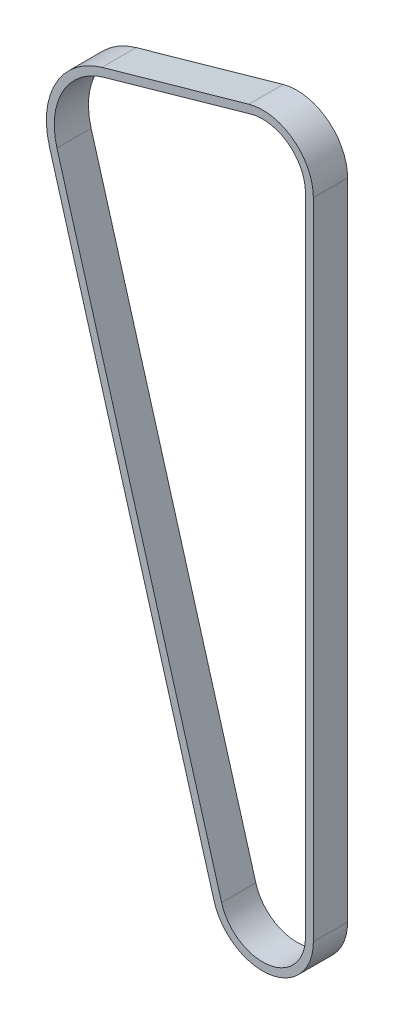
ISO-10303-21;
HEADER;
FILE_DESCRIPTION(('STEP AP214'),'2;1');
FILE_NAME('part.step','',(''),(''),'','','');
FILE_SCHEMA(('AUTOMOTIVE_DESIGN { 1 0 10303 214 1 1 1 1 }'));
ENDSEC;
DATA;
#1=APPLICATION_CONTEXT('core data for automotive mechanical design processes');
#2=APPLICATION_PROTOCOL_DEFINITION('international standard','automotive_design',2000,#1);
#3=PRODUCT_CONTEXT('',#1,'mechanical');
#4=PRODUCT('Part','Part','',(#3));
#5=PRODUCT_RELATED_PRODUCT_CATEGORY('part','',(#4));
#6=PRODUCT_DEFINITION_FORMATION('','',#4);
#7=PRODUCT_DEFINITION_CONTEXT('part definition',#1,'design');
#8=PRODUCT_DEFINITION('design','',#6,#7);
#9=PRODUCT_DEFINITION_SHAPE('','',#8);
#10=(LENGTH_UNIT() NAMED_UNIT(*) SI_UNIT(.MILLI.,.METRE.));
#11=(NAMED_UNIT(*) PLANE_ANGLE_UNIT() SI_UNIT($,.RADIAN.));
#12=(NAMED_UNIT(*) SI_UNIT($,.STERADIAN.) SOLID_ANGLE_UNIT());
#13=UNCERTAINTY_MEASURE_WITH_UNIT(LENGTH_MEASURE(1.E-05),#10,'distance_accuracy_value','');
#14=(GEOMETRIC_REPRESENTATION_CONTEXT(3) GLOBAL_UNCERTAINTY_ASSIGNED_CONTEXT((#13)) GLOBAL_UNIT_ASSIGNED_CONTEXT((#10,
#11,#12)) REPRESENTATION_CONTEXT('',''));
#15=CARTESIAN_POINT('',(0.,0.,0.));
#16=DIRECTION('',(0.,0.,1.));
#17=DIRECTION('',(1.,0.,0.));
#18=AXIS2_PLACEMENT_3D('',#15,#16,#17);
#19=CARTESIAN_POINT('',(-10.0179356323883,44.8653931890896,6.));
#20=DIRECTION('',(0.,0.,1.));
#21=DIRECTION('',(1.,0.,0.));
#22=AXIS2_PLACEMENT_3D('',#19,#20,#21);
#23=PLANE('',#22);
#24=CARTESIAN_POINT('',(-10.0179356323883,44.8653931890896,6.));
#25=DIRECTION('',(0.,0.,1.));
#26=DIRECTION('',(1.,0.,0.));
#27=AXIS2_PLACEMENT_3D('',#24,#25,#26);
#28=CIRCLE('',#27,13.38);
#29=CARTESIAN_POINT('',(-13.6594568226901,57.7403193411334,6.));
#30=VERTEX_POINT('',#29);
#31=CARTESIAN_POINT('',(-22.8742804471024,41.1588047299843,6.));
#32=VERTEX_POINT('',#31);
#33=EDGE_CURVE('E208',#30,#32,#28,.T.);
#34=ORIENTED_EDGE('',*,*,#33,.T.);
#35=DIRECTION('',(0.277024548513102,-0.960862841159503,0.));
#36=VECTOR('',#35,1.);
#37=CARTESIAN_POINT('',(-22.8742804471024,41.1588047299843,6.));
#38=LINE('',#37,#36);
#39=CARTESIAN_POINT('',(5.98547360289192,-58.941585002554,6.));
#40=VERTEX_POINT('',#39);
#41=EDGE_CURVE('E211',#32,#40,#38,.T.);
#42=ORIENTED_EDGE('',*,*,#41,.T.);
#43=CARTESIAN_POINT('',(14.5179356323883,-56.4816070117576,6.));
#44=DIRECTION('',(0.,0.,1.));
#45=DIRECTION('',(1.,0.,0.));
#46=AXIS2_PLACEMENT_3D('',#43,#44,#45);
#47=CIRCLE('',#46,8.87999999999999);
#48=CARTESIAN_POINT('',(23.3979356323883,-56.4816070117576,6.));
#49=VERTEX_POINT('',#48);
#50=EDGE_CURVE('E214',#40,#49,#47,.T.);
#51=ORIENTED_EDGE('',*,*,#50,.T.);
#52=DIRECTION('',(0.,-1.,0.));
#53=VECTOR('',#52,1.);
#54=CARTESIAN_POINT('',(23.3979356323883,56.4816070117576,6.));
#55=LINE('',#54,#53);
#56=CARTESIAN_POINT('',(23.3979356323883,56.4816070117576,6.));
#57=VERTEX_POINT('',#56);
#58=EDGE_CURVE('E216',#57,#49,#55,.T.);
#59=ORIENTED_EDGE('',*,*,#58,.F.);
#60=CARTESIAN_POINT('',(14.5179356323883,56.4816070117576,6.));
#61=DIRECTION('',(0.,0.,1.));
#62=DIRECTION('',(1.,0.,0.));
#63=AXIS2_PLACEMENT_3D('',#60,#61,#62);
#64=CIRCLE('',#63,8.88000000000001);
#65=CARTESIAN_POINT('',(12.1011412998113,65.0264010498854,6.));
#66=VERTEX_POINT('',#65);
#67=EDGE_CURVE('E219',#57,#66,#64,.T.);
#68=ORIENTED_EDGE('',*,*,#67,.T.);
#69=DIRECTION('',(0.962251580870243,0.272161523938852,0.));
#70=VECTOR('',#69,1.);
#71=CARTESIAN_POINT('',(-13.6594568226901,57.7403193411334,6.));
#72=LINE('',#71,#70);
#73=EDGE_CURVE('E221',#30,#66,#72,.T.);
#74=ORIENTED_EDGE('',*,*,#73,.F.);
#75=EDGE_LOOP('',(#34,#42,#51,#59,#68,#74));
#76=FACE_BOUND('',#75,.T.);
#77=DIRECTION('',(0.277024548513102,-0.960862841159503,0.));
#78=VECTOR('',#77,1.);
#79=CARTESIAN_POINT('',(-21.5482897263023,41.5410986069324,6.));
#80=LINE('',#79,#78);
#81=CARTESIAN_POINT('',(-21.5482897263023,41.5410986069324,6.));
#82=VERTEX_POINT('',#81);
#83=CARTESIAN_POINT('',(7.31146432369202,-58.5592911256059,6.));
#84=VERTEX_POINT('',#83);
#85=EDGE_CURVE('E166',#82,#84,#80,.T.);
#86=ORIENTED_EDGE('',*,*,#85,.F.);
#87=CARTESIAN_POINT('',(-10.0179356323883,44.8653931890896,6.));
#88=DIRECTION('',(0.,0.,1.));
#89=DIRECTION('',(1.,0.,0.));
#90=AXIS2_PLACEMENT_3D('',#87,#88,#89);
#91=CIRCLE('',#90,12.);
#92=CARTESIAN_POINT('',(-13.2838739196545,56.4124121595325,6.));
#93=VERTEX_POINT('',#92);
#94=EDGE_CURVE('E158',#93,#82,#91,.T.);
#95=ORIENTED_EDGE('',*,*,#94,.F.);
#96=DIRECTION('',(0.962251580870243,0.272161523938852,0.));
#97=VECTOR('',#96,1.);
#98=CARTESIAN_POINT('',(-13.2838739196545,56.4124121595325,6.));
#99=LINE('',#98,#97);
#100=CARTESIAN_POINT('',(12.4767242028469,63.6984938682845,6.));
#101=VERTEX_POINT('',#100);
#102=EDGE_CURVE('E187',#93,#101,#99,.T.);
#103=ORIENTED_EDGE('',*,*,#102,.T.);
#104=CARTESIAN_POINT('',(14.5179356323883,56.4816070117576,6.));
#105=DIRECTION('',(0.,0.,1.));
#106=DIRECTION('',(1.,0.,0.));
#107=AXIS2_PLACEMENT_3D('',#104,#105,#106);
#108=CIRCLE('',#107,7.50000000000001);
#109=CARTESIAN_POINT('',(22.0179356323883,56.4816070117576,6.));
#110=VERTEX_POINT('',#109);
#111=EDGE_CURVE('E185',#110,#101,#108,.T.);
#112=ORIENTED_EDGE('',*,*,#111,.F.);
#113=DIRECTION('',(0.,-1.,0.));
#114=VECTOR('',#113,1.);
#115=CARTESIAN_POINT('',(22.0179356323883,56.4816070117576,6.));
#116=LINE('',#115,#114);
#117=CARTESIAN_POINT('',(22.0179356323883,-56.4816070117576,6.));
#118=VERTEX_POINT('',#117);
#119=EDGE_CURVE('E181',#110,#118,#116,.T.);
#120=ORIENTED_EDGE('',*,*,#119,.T.);
#121=CARTESIAN_POINT('',(14.5179356323883,-56.4816070117576,6.));
#122=DIRECTION('',(0.,0.,1.));
#123=DIRECTION('',(1.,0.,0.));
#124=AXIS2_PLACEMENT_3D('',#121,#122,#123);
#125=CIRCLE('',#124,7.49999999999999);
#126=EDGE_CURVE('E179',#84,#118,#125,.T.);
#127=ORIENTED_EDGE('',*,*,#126,.F.);
#128=EDGE_LOOP('',(#86,#95,#103,#112,#120,#127));
#129=FACE_BOUND('',#128,.T.);
#130=ADVANCED_FACE('F69',(#76,#129),#23,.T.);
#131=CARTESIAN_POINT('',(-10.0179356323883,44.8653931890896,0.));
#132=DIRECTION('',(0.,0.,1.));
#133=DIRECTION('',(1.,0.,0.));
#134=AXIS2_PLACEMENT_3D('',#131,#132,#133);
#135=PLANE('',#134);
#136=CARTESIAN_POINT('',(-10.0179356323883,44.8653931890896,0.));
#137=DIRECTION('',(0.,0.,1.));
#138=DIRECTION('',(1.,0.,0.));
#139=AXIS2_PLACEMENT_3D('',#136,#137,#138);
#140=CIRCLE('',#139,13.38);
#141=CARTESIAN_POINT('',(-13.6594568226901,57.7403193411334,0.));
#142=VERTEX_POINT('',#141);
#143=CARTESIAN_POINT('',(-22.8742804471024,41.1588047299843,0.));
#144=VERTEX_POINT('',#143);
#145=EDGE_CURVE('E174',#142,#144,#140,.T.);
#146=ORIENTED_EDGE('',*,*,#145,.F.);
#147=DIRECTION('',(0.962251580870243,0.272161523938852,0.));
#148=VECTOR('',#147,1.);
#149=CARTESIAN_POINT('',(-13.6594568226901,57.7403193411334,0.));
#150=LINE('',#149,#148);
#151=CARTESIAN_POINT('',(12.1011412998113,65.0264010498854,0.));
#152=VERTEX_POINT('',#151);
#153=EDGE_CURVE('E212',#142,#152,#150,.T.);
#154=ORIENTED_EDGE('',*,*,#153,.T.);
#155=CARTESIAN_POINT('',(14.5179356323883,56.4816070117576,0.));
#156=DIRECTION('',(0.,0.,1.));
#157=DIRECTION('',(1.,0.,0.));
#158=AXIS2_PLACEMENT_3D('',#155,#156,#157);
#159=CIRCLE('',#158,8.88000000000001);
#160=CARTESIAN_POINT('',(23.3979356323883,56.4816070117576,0.));
#161=VERTEX_POINT('',#160);
#162=EDGE_CURVE('E235',#161,#152,#159,.T.);
#163=ORIENTED_EDGE('',*,*,#162,.F.);
#164=DIRECTION('',(0.,-1.,0.));
#165=VECTOR('',#164,1.);
#166=CARTESIAN_POINT('',(23.3979356323883,56.4816070117576,0.));
#167=LINE('',#166,#165);
#168=CARTESIAN_POINT('',(23.3979356323883,-56.4816070117576,0.));
#169=VERTEX_POINT('',#168);
#170=EDGE_CURVE('E232',#161,#169,#167,.T.);
#171=ORIENTED_EDGE('',*,*,#170,.T.);
#172=CARTESIAN_POINT('',(14.5179356323883,-56.4816070117576,0.));
#173=DIRECTION('',(0.,0.,1.));
#174=DIRECTION('',(1.,0.,0.));
#175=AXIS2_PLACEMENT_3D('',#172,#173,#174);
#176=CIRCLE('',#175,8.87999999999999);
#177=CARTESIAN_POINT('',(5.98547360289192,-58.941585002554,0.));
#178=VERTEX_POINT('',#177);
#179=EDGE_CURVE('E229',#178,#169,#176,.T.);
#180=ORIENTED_EDGE('',*,*,#179,.F.);
#181=DIRECTION('',(0.277024548513102,-0.960862841159503,0.));
#182=VECTOR('',#181,1.);
#183=CARTESIAN_POINT('',(-22.8742804471024,41.1588047299843,0.));
#184=LINE('',#183,#182);
#185=EDGE_CURVE('E227',#144,#178,#184,.T.);
#186=ORIENTED_EDGE('',*,*,#185,.F.);
#187=EDGE_LOOP('',(#146,#154,#163,#171,#180,#186));
#188=FACE_BOUND('',#187,.T.);
#189=CARTESIAN_POINT('',(-10.0179356323883,44.8653931890896,0.));
#190=DIRECTION('',(0.,0.,1.));
#191=DIRECTION('',(1.,0.,0.));
#192=AXIS2_PLACEMENT_3D('',#189,#190,#191);
#193=CIRCLE('',#192,12.);
#194=CARTESIAN_POINT('',(-13.2838739196545,56.4124121595325,0.));
#195=VERTEX_POINT('',#194);
#196=CARTESIAN_POINT('',(-21.5482897263023,41.5410986069324,0.));
#197=VERTEX_POINT('',#196);
#198=EDGE_CURVE('E92',#195,#197,#193,.T.);
#199=ORIENTED_EDGE('',*,*,#198,.T.);
#200=DIRECTION('',(0.277024548513102,-0.960862841159503,0.));
#201=VECTOR('',#200,1.);
#202=CARTESIAN_POINT('',(-21.5482897263023,41.5410986069324,0.));
#203=LINE('',#202,#201);
#204=CARTESIAN_POINT('',(7.31146432369202,-58.5592911256059,0.));
#205=VERTEX_POINT('',#204);
#206=EDGE_CURVE('E173',#197,#205,#203,.T.);
#207=ORIENTED_EDGE('',*,*,#206,.T.);
#208=CARTESIAN_POINT('',(14.5179356323883,-56.4816070117576,0.));
#209=DIRECTION('',(0.,0.,1.));
#210=DIRECTION('',(1.,0.,0.));
#211=AXIS2_PLACEMENT_3D('',#208,#209,#210);
#212=CIRCLE('',#211,7.49999999999999);
#213=CARTESIAN_POINT('',(22.0179356323883,-56.4816070117576,0.));
#214=VERTEX_POINT('',#213);
#215=EDGE_CURVE('E191',#205,#214,#212,.T.);
#216=ORIENTED_EDGE('',*,*,#215,.T.);
#217=DIRECTION('',(0.,-1.,0.));
#218=VECTOR('',#217,1.);
#219=CARTESIAN_POINT('',(22.0179356323883,56.4816070117576,0.));
#220=LINE('',#219,#218);
#221=CARTESIAN_POINT('',(22.0179356323883,56.4816070117576,0.));
#222=VERTEX_POINT('',#221);
#223=EDGE_CURVE('E194',#222,#214,#220,.T.);
#224=ORIENTED_EDGE('',*,*,#223,.F.);
#225=CARTESIAN_POINT('',(14.5179356323883,56.4816070117576,0.));
#226=DIRECTION('',(0.,0.,1.));
#227=DIRECTION('',(1.,0.,0.));
#228=AXIS2_PLACEMENT_3D('',#225,#226,#227);
#229=CIRCLE('',#228,7.50000000000001);
#230=CARTESIAN_POINT('',(12.4767242028469,63.6984938682845,0.));
#231=VERTEX_POINT('',#230);
#232=EDGE_CURVE('E197',#222,#231,#229,.T.);
#233=ORIENTED_EDGE('',*,*,#232,.T.);
#234=DIRECTION('',(0.962251580870243,0.272161523938852,0.));
#235=VECTOR('',#234,1.);
#236=CARTESIAN_POINT('',(-13.2838739196545,56.4124121595325,0.));
#237=LINE('',#236,#235);
#238=EDGE_CURVE('E167',#195,#231,#237,.T.);
#239=ORIENTED_EDGE('',*,*,#238,.F.);
#240=EDGE_LOOP('',(#199,#207,#216,#224,#233,#239));
#241=FACE_BOUND('',#240,.T.);
#242=ADVANCED_FACE('F256',(#188,#241),#135,.F.);
#243=CARTESIAN_POINT('',(-10.0179356323883,44.8653931890896,6.));
#244=DIRECTION('',(0.,0.,-1.));
#245=DIRECTION('',(-1.,0.,0.));
#246=AXIS2_PLACEMENT_3D('',#243,#244,#245);
#247=CYLINDRICAL_SURFACE('',#246,13.38);
#248=ORIENTED_EDGE('',*,*,#145,.T.);
#249=DIRECTION('',(0.,0.,-1.));
#250=VECTOR('',#249,1.);
#251=CARTESIAN_POINT('',(-22.8742804471024,41.1588047299843,6.));
#252=LINE('',#251,#250);
#253=EDGE_CURVE('E12',#32,#144,#252,.T.);
#254=ORIENTED_EDGE('',*,*,#253,.F.);
#255=ORIENTED_EDGE('',*,*,#33,.F.);
#256=DIRECTION('',(0.,0.,-1.));
#257=VECTOR('',#256,1.);
#258=CARTESIAN_POINT('',(-13.6594568226901,57.7403193411334,6.));
#259=LINE('',#258,#257);
#260=EDGE_CURVE('E224',#30,#142,#259,.T.);
#261=ORIENTED_EDGE('',*,*,#260,.T.);
#262=EDGE_LOOP('',(#248,#254,#255,#261));
#263=FACE_BOUND('',#262,.T.);
#264=ADVANCED_FACE('F71',(#263),#247,.T.);
#265=CARTESIAN_POINT('',(-22.8742804471024,41.1588047299843,6.));
#266=DIRECTION('',(0.960862841159503,0.277024548513102,0.));
#267=DIRECTION('',(-0.277024548513102,0.960862841159503,0.));
#268=AXIS2_PLACEMENT_3D('',#265,#266,#267);
#269=PLANE('',#268);
#270=ORIENTED_EDGE('',*,*,#185,.T.);
#271=DIRECTION('',(0.,0.,-1.));
#272=VECTOR('',#271,1.);
#273=CARTESIAN_POINT('',(5.98547360289192,-58.941585002554,6.));
#274=LINE('',#273,#272);
#275=EDGE_CURVE('E77',#40,#178,#274,.T.);
#276=ORIENTED_EDGE('',*,*,#275,.F.);
#277=ORIENTED_EDGE('',*,*,#41,.F.);
#278=ORIENTED_EDGE('',*,*,#253,.T.);
#279=EDGE_LOOP('',(#270,#276,#277,#278));
#280=FACE_BOUND('',#279,.T.);
#281=ADVANCED_FACE('F269',(#280),#269,.F.);
#282=CARTESIAN_POINT('',(14.5179356323883,-56.4816070117576,6.));
#283=DIRECTION('',(0.,0.,-1.));
#284=DIRECTION('',(-1.,0.,0.));
#285=AXIS2_PLACEMENT_3D('',#282,#283,#284);
#286=CYLINDRICAL_SURFACE('',#285,8.87999999999999);
#287=ORIENTED_EDGE('',*,*,#179,.T.);
#288=DIRECTION('',(0.,0.,-1.));
#289=VECTOR('',#288,1.);
#290=CARTESIAN_POINT('',(23.3979356323883,-56.4816070117576,6.));
#291=LINE('',#290,#289);
#292=EDGE_CURVE('E245',#49,#169,#291,.T.);
#293=ORIENTED_EDGE('',*,*,#292,.F.);
#294=ORIENTED_EDGE('',*,*,#50,.F.);
#295=ORIENTED_EDGE('',*,*,#275,.T.);
#296=EDGE_LOOP('',(#287,#293,#294,#295));
#297=FACE_BOUND('',#296,.T.);
#298=ADVANCED_FACE('F251',(#297),#286,.T.);
#299=CARTESIAN_POINT('',(23.3979356323883,56.4816070117576,6.));
#300=DIRECTION('',(1.,0.,0.));
#301=DIRECTION('',(0.,0.,-1.));
#302=AXIS2_PLACEMENT_3D('',#299,#300,#301);
#303=PLANE('',#302);
#304=ORIENTED_EDGE('',*,*,#170,.F.);
#305=DIRECTION('',(0.,0.,-1.));
#306=VECTOR('',#305,1.);
#307=CARTESIAN_POINT('',(23.3979356323883,56.4816070117576,6.));
#308=LINE('',#307,#306);
#309=EDGE_CURVE('E243',#57,#161,#308,.T.);
#310=ORIENTED_EDGE('',*,*,#309,.F.);
#311=ORIENTED_EDGE('',*,*,#58,.T.);
#312=ORIENTED_EDGE('',*,*,#292,.T.);
#313=EDGE_LOOP('',(#304,#310,#311,#312));
#314=FACE_BOUND('',#313,.T.);
#315=ADVANCED_FACE('F261',(#314),#303,.T.);
#316=CARTESIAN_POINT('',(14.5179356323883,56.4816070117576,6.));
#317=DIRECTION('',(0.,0.,-1.));
#318=DIRECTION('',(-1.,0.,0.));
#319=AXIS2_PLACEMENT_3D('',#316,#317,#318);
#320=CYLINDRICAL_SURFACE('',#319,8.88000000000001);
#321=ORIENTED_EDGE('',*,*,#162,.T.);
#322=DIRECTION('',(0.,0.,-1.));
#323=VECTOR('',#322,1.);
#324=CARTESIAN_POINT('',(12.1011412998113,65.0264010498854,6.));
#325=LINE('',#324,#323);
#326=EDGE_CURVE('E241',#66,#152,#325,.T.);
#327=ORIENTED_EDGE('',*,*,#326,.F.);
#328=ORIENTED_EDGE('',*,*,#67,.F.);
#329=ORIENTED_EDGE('',*,*,#309,.T.);
#330=EDGE_LOOP('',(#321,#327,#328,#329));
#331=FACE_BOUND('',#330,.T.);
#332=ADVANCED_FACE('F275',(#331),#320,.T.);
#333=CARTESIAN_POINT('',(-13.6594568226901,57.7403193411334,6.));
#334=DIRECTION('',(-0.272161523938852,0.962251580870243,0.));
#335=DIRECTION('',(-0.962251580870243,-0.272161523938852,0.));
#336=AXIS2_PLACEMENT_3D('',#333,#334,#335);
#337=PLANE('',#336);
#338=ORIENTED_EDGE('',*,*,#153,.F.);
#339=ORIENTED_EDGE('',*,*,#260,.F.);
#340=ORIENTED_EDGE('',*,*,#73,.T.);
#341=ORIENTED_EDGE('',*,*,#326,.T.);
#342=EDGE_LOOP('',(#338,#339,#340,#341));
#343=FACE_BOUND('',#342,.T.);
#344=ADVANCED_FACE('F273',(#343),#337,.T.);
#345=CARTESIAN_POINT('',(-10.0179356323883,44.8653931890896,6.));
#346=DIRECTION('',(0.,0.,-1.));
#347=DIRECTION('',(-1.,0.,0.));
#348=AXIS2_PLACEMENT_3D('',#345,#346,#347);
#349=CYLINDRICAL_SURFACE('',#348,12.);
#350=ORIENTED_EDGE('',*,*,#198,.F.);
#351=DIRECTION('',(0.,0.,-1.));
#352=VECTOR('',#351,1.);
#353=CARTESIAN_POINT('',(-13.2838739196545,56.4124121595325,6.));
#354=LINE('',#353,#352);
#355=EDGE_CURVE('E162',#93,#195,#354,.T.);
#356=ORIENTED_EDGE('',*,*,#355,.F.);
#357=ORIENTED_EDGE('',*,*,#94,.T.);
#358=DIRECTION('',(0.,0.,-1.));
#359=VECTOR('',#358,1.);
#360=CARTESIAN_POINT('',(-21.5482897263023,41.5410986069324,6.));
#361=LINE('',#360,#359);
#362=EDGE_CURVE('E161',#82,#197,#361,.T.);
#363=ORIENTED_EDGE('',*,*,#362,.T.);
#364=EDGE_LOOP('',(#350,#356,#357,#363));
#365=FACE_BOUND('',#364,.T.);
#366=ADVANCED_FACE('F160',(#365),#349,.F.);
#367=CARTESIAN_POINT('',(-21.5482897263023,41.5410986069324,6.));
#368=DIRECTION('',(0.960862841159503,0.277024548513102,0.));
#369=DIRECTION('',(-0.277024548513102,0.960862841159503,0.));
#370=AXIS2_PLACEMENT_3D('',#367,#368,#369);
#371=PLANE('',#370);
#372=ORIENTED_EDGE('',*,*,#206,.F.);
#373=ORIENTED_EDGE('',*,*,#362,.F.);
#374=ORIENTED_EDGE('',*,*,#85,.T.);
#375=DIRECTION('',(0.,0.,-1.));
#376=VECTOR('',#375,1.);
#377=CARTESIAN_POINT('',(7.31146432369202,-58.5592911256059,6.));
#378=LINE('',#377,#376);
#379=EDGE_CURVE('E175',#84,#205,#378,.T.);
#380=ORIENTED_EDGE('',*,*,#379,.T.);
#381=EDGE_LOOP('',(#372,#373,#374,#380));
#382=FACE_BOUND('',#381,.T.);
#383=ADVANCED_FACE('F170',(#382),#371,.T.);
#384=CARTESIAN_POINT('',(14.5179356323883,-56.4816070117576,6.));
#385=DIRECTION('',(0.,0.,-1.));
#386=DIRECTION('',(-1.,0.,0.));
#387=AXIS2_PLACEMENT_3D('',#384,#385,#386);
#388=CYLINDRICAL_SURFACE('',#387,7.49999999999999);
#389=ORIENTED_EDGE('',*,*,#215,.F.);
#390=ORIENTED_EDGE('',*,*,#379,.F.);
#391=ORIENTED_EDGE('',*,*,#126,.T.);
#392=DIRECTION('',(0.,0.,-1.));
#393=VECTOR('',#392,1.);
#394=CARTESIAN_POINT('',(22.0179356323883,-56.4816070117576,6.));
#395=LINE('',#394,#393);
#396=EDGE_CURVE('E205',#118,#214,#395,.T.);
#397=ORIENTED_EDGE('',*,*,#396,.T.);
#398=EDGE_LOOP('',(#389,#390,#391,#397));
#399=FACE_BOUND('',#398,.T.);
#400=ADVANCED_FACE('F295',(#399),#388,.F.);
#401=CARTESIAN_POINT('',(22.0179356323883,56.4816070117576,6.));
#402=DIRECTION('',(1.,0.,0.));
#403=DIRECTION('',(0.,0.,-1.));
#404=AXIS2_PLACEMENT_3D('',#401,#402,#403);
#405=PLANE('',#404);
#406=ORIENTED_EDGE('',*,*,#223,.T.);
#407=ORIENTED_EDGE('',*,*,#396,.F.);
#408=ORIENTED_EDGE('',*,*,#119,.F.);
#409=DIRECTION('',(0.,0.,-1.));
#410=VECTOR('',#409,1.);
#411=CARTESIAN_POINT('',(22.0179356323883,56.4816070117576,6.));
#412=LINE('',#411,#410);
#413=EDGE_CURVE('E203',#110,#222,#412,.T.);
#414=ORIENTED_EDGE('',*,*,#413,.T.);
#415=EDGE_LOOP('',(#406,#407,#408,#414));
#416=FACE_BOUND('',#415,.T.);
#417=ADVANCED_FACE('F298',(#416),#405,.F.);
#418=CARTESIAN_POINT('',(14.5179356323883,56.4816070117576,6.));
#419=DIRECTION('',(0.,0.,-1.));
#420=DIRECTION('',(-1.,0.,0.));
#421=AXIS2_PLACEMENT_3D('',#418,#419,#420);
#422=CYLINDRICAL_SURFACE('',#421,7.50000000000001);
#423=ORIENTED_EDGE('',*,*,#232,.F.);
#424=ORIENTED_EDGE('',*,*,#413,.F.);
#425=ORIENTED_EDGE('',*,*,#111,.T.);
#426=DIRECTION('',(0.,0.,-1.));
#427=VECTOR('',#426,1.);
#428=CARTESIAN_POINT('',(12.4767242028469,63.6984938682845,6.));
#429=LINE('',#428,#427);
#430=EDGE_CURVE('E84',#101,#231,#429,.T.);
#431=ORIENTED_EDGE('',*,*,#430,.T.);
#432=EDGE_LOOP('',(#423,#424,#425,#431));
#433=FACE_BOUND('',#432,.T.);
#434=ADVANCED_FACE('F302',(#433),#422,.F.);
#435=CARTESIAN_POINT('',(-13.2838739196545,56.4124121595325,6.));
#436=DIRECTION('',(-0.272161523938852,0.962251580870243,0.));
#437=DIRECTION('',(-0.962251580870243,-0.272161523938852,0.));
#438=AXIS2_PLACEMENT_3D('',#435,#436,#437);
#439=PLANE('',#438);
#440=ORIENTED_EDGE('',*,*,#238,.T.);
#441=ORIENTED_EDGE('',*,*,#430,.F.);
#442=ORIENTED_EDGE('',*,*,#102,.F.);
#443=ORIENTED_EDGE('',*,*,#355,.T.);
#444=EDGE_LOOP('',(#440,#441,#442,#443));
#445=FACE_BOUND('',#444,.T.);
#446=ADVANCED_FACE('F306',(#445),#439,.F.);
#447=CLOSED_SHELL('',(#130,#242,#264,#281,#298,#315,#332,#344,#366,#383,#400,#417,#434,#446));
#448=MANIFOLD_SOLID_BREP('B2',#447);
#449=ADVANCED_BREP_SHAPE_REPRESENTATION('',(#18,#448),#14);
#450=SHAPE_DEFINITION_REPRESENTATION(#9,#449);
ENDSEC;
END-ISO-10303-21;
